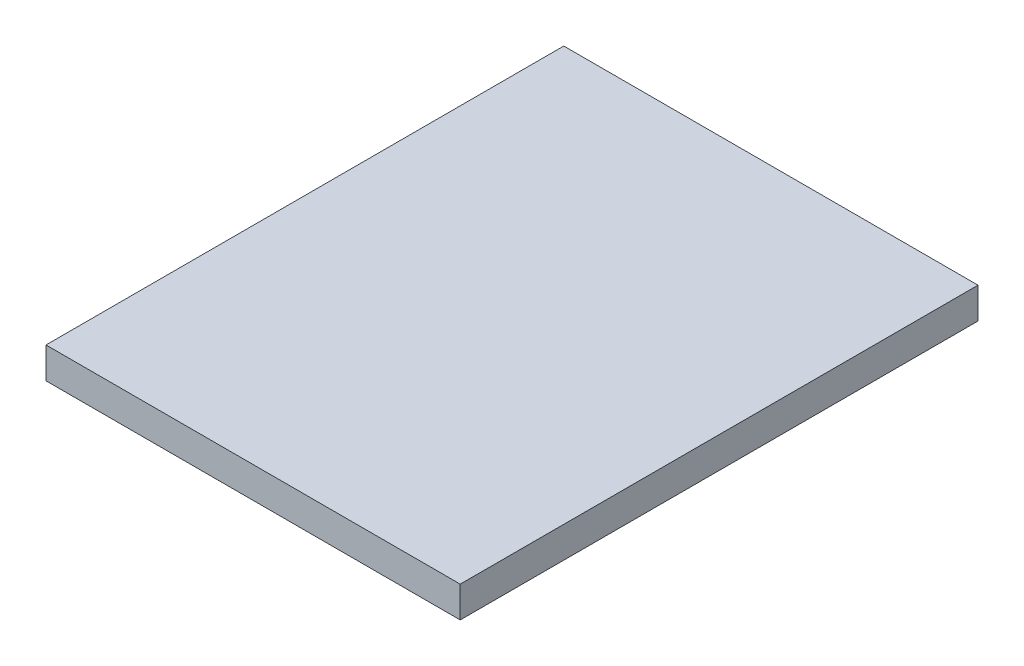
ISO-10303-21;
HEADER;
FILE_DESCRIPTION(('STEP AP214'),'2;1');
FILE_NAME('part.step','',(''),(''),'','','');
FILE_SCHEMA(('AUTOMOTIVE_DESIGN { 1 0 10303 214 1 1 1 1 }'));
ENDSEC;
DATA;
#1=APPLICATION_CONTEXT('core data for automotive mechanical design processes');
#2=APPLICATION_PROTOCOL_DEFINITION('international standard','automotive_design',2000,#1);
#3=PRODUCT_CONTEXT('',#1,'mechanical');
#4=PRODUCT('Part','Part','',(#3));
#5=PRODUCT_RELATED_PRODUCT_CATEGORY('part','',(#4));
#6=PRODUCT_DEFINITION_FORMATION('','',#4);
#7=PRODUCT_DEFINITION_CONTEXT('part definition',#1,'design');
#8=PRODUCT_DEFINITION('design','',#6,#7);
#9=PRODUCT_DEFINITION_SHAPE('','',#8);
#10=(LENGTH_UNIT() NAMED_UNIT(*) SI_UNIT(.MILLI.,.METRE.));
#11=(NAMED_UNIT(*) PLANE_ANGLE_UNIT() SI_UNIT($,.RADIAN.));
#12=(NAMED_UNIT(*) SI_UNIT($,.STERADIAN.) SOLID_ANGLE_UNIT());
#13=UNCERTAINTY_MEASURE_WITH_UNIT(LENGTH_MEASURE(1.E-05),#10,'distance_accuracy_value','');
#14=(GEOMETRIC_REPRESENTATION_CONTEXT(3) GLOBAL_UNCERTAINTY_ASSIGNED_CONTEXT((#13)) GLOBAL_UNIT_ASSIGNED_CONTEXT((#10,
#11,#12)) REPRESENTATION_CONTEXT('',''));
#15=CARTESIAN_POINT('',(0.,0.,0.));
#16=DIRECTION('',(0.,0.,1.));
#17=DIRECTION('',(1.,0.,0.));
#18=AXIS2_PLACEMENT_3D('',#15,#16,#17);
#19=CARTESIAN_POINT('',(-260.,25.5,325.));
#20=DIRECTION('',(1.,0.,0.));
#21=DIRECTION('',(0.,0.,-1.));
#22=AXIS2_PLACEMENT_3D('',#19,#20,#21);
#23=PLANE('',#22);
#24=DIRECTION('',(0.,0.,1.));
#25=VECTOR('',#24,1.);
#26=CARTESIAN_POINT('',(-260.,-19.5,325.));
#27=LINE('',#26,#25);
#28=CARTESIAN_POINT('',(-260.,-19.5,-425.));
#29=VERTEX_POINT('',#28);
#30=CARTESIAN_POINT('',(-260.,-19.5,325.));
#31=VERTEX_POINT('',#30);
#32=EDGE_CURVE('E106',#29,#31,#27,.T.);
#33=ORIENTED_EDGE('',*,*,#32,.T.);
#34=DIRECTION('',(0.,-1.,0.));
#35=VECTOR('',#34,1.);
#36=CARTESIAN_POINT('',(-260.,25.5,325.));
#37=LINE('',#36,#35);
#38=CARTESIAN_POINT('',(-260.,25.5,325.));
#39=VERTEX_POINT('',#38);
#40=EDGE_CURVE('E11',#39,#31,#37,.T.);
#41=ORIENTED_EDGE('',*,*,#40,.F.);
#42=DIRECTION('',(0.,0.,1.));
#43=VECTOR('',#42,1.);
#44=CARTESIAN_POINT('',(-260.,25.5,325.));
#45=LINE('',#44,#43);
#46=CARTESIAN_POINT('',(-260.,25.5,-425.));
#47=VERTEX_POINT('',#46);
#48=EDGE_CURVE('E90',#47,#39,#45,.T.);
#49=ORIENTED_EDGE('',*,*,#48,.F.);
#50=DIRECTION('',(0.,-1.,0.));
#51=VECTOR('',#50,1.);
#52=CARTESIAN_POINT('',(-260.,25.5,-425.));
#53=LINE('',#52,#51);
#54=EDGE_CURVE('E102',#47,#29,#53,.T.);
#55=ORIENTED_EDGE('',*,*,#54,.T.);
#56=EDGE_LOOP('',(#33,#41,#49,#55));
#57=FACE_BOUND('',#56,.T.);
#58=ADVANCED_FACE('F38',(#57),#23,.F.);
#59=CARTESIAN_POINT('',(-260.,25.5,325.));
#60=DIRECTION('',(0.,0.,-1.));
#61=DIRECTION('',(-1.,0.,0.));
#62=AXIS2_PLACEMENT_3D('',#59,#60,#61);
#63=PLANE('',#62);
#64=DIRECTION('',(1.,0.,0.));
#65=VECTOR('',#64,1.);
#66=CARTESIAN_POINT('',(-260.,-19.5,325.));
#67=LINE('',#66,#65);
#68=CARTESIAN_POINT('',(340.,-19.5,325.));
#69=VERTEX_POINT('',#68);
#70=EDGE_CURVE('E95',#31,#69,#67,.T.);
#71=ORIENTED_EDGE('',*,*,#70,.T.);
#72=DIRECTION('',(0.,-1.,0.));
#73=VECTOR('',#72,1.);
#74=CARTESIAN_POINT('',(340.,25.5,325.));
#75=LINE('',#74,#73);
#76=CARTESIAN_POINT('',(340.,25.5,325.));
#77=VERTEX_POINT('',#76);
#78=EDGE_CURVE('E47',#77,#69,#75,.T.);
#79=ORIENTED_EDGE('',*,*,#78,.F.);
#80=DIRECTION('',(1.,0.,0.));
#81=VECTOR('',#80,1.);
#82=CARTESIAN_POINT('',(-260.,25.5,325.));
#83=LINE('',#82,#81);
#84=EDGE_CURVE('E85',#39,#77,#83,.T.);
#85=ORIENTED_EDGE('',*,*,#84,.F.);
#86=ORIENTED_EDGE('',*,*,#40,.T.);
#87=EDGE_LOOP('',(#71,#79,#85,#86));
#88=FACE_BOUND('',#87,.T.);
#89=ADVANCED_FACE('F94',(#88),#63,.F.);
#90=CARTESIAN_POINT('',(340.,25.5,325.));
#91=DIRECTION('',(-1.,0.,0.));
#92=DIRECTION('',(0.,0.,1.));
#93=AXIS2_PLACEMENT_3D('',#90,#91,#92);
#94=PLANE('',#93);
#95=DIRECTION('',(0.,0.,-1.));
#96=VECTOR('',#95,1.);
#97=CARTESIAN_POINT('',(340.,-19.5,325.));
#98=LINE('',#97,#96);
#99=CARTESIAN_POINT('',(340.,-19.5,-425.));
#100=VERTEX_POINT('',#99);
#101=EDGE_CURVE('E72',#69,#100,#98,.T.);
#102=ORIENTED_EDGE('',*,*,#101,.T.);
#103=DIRECTION('',(0.,-1.,0.));
#104=VECTOR('',#103,1.);
#105=CARTESIAN_POINT('',(340.,25.5,-425.));
#106=LINE('',#105,#104);
#107=CARTESIAN_POINT('',(340.,25.5,-425.));
#108=VERTEX_POINT('',#107);
#109=EDGE_CURVE('E97',#108,#100,#106,.T.);
#110=ORIENTED_EDGE('',*,*,#109,.F.);
#111=DIRECTION('',(0.,0.,-1.));
#112=VECTOR('',#111,1.);
#113=CARTESIAN_POINT('',(340.,25.5,325.));
#114=LINE('',#113,#112);
#115=EDGE_CURVE('E88',#77,#108,#114,.T.);
#116=ORIENTED_EDGE('',*,*,#115,.F.);
#117=ORIENTED_EDGE('',*,*,#78,.T.);
#118=EDGE_LOOP('',(#102,#110,#116,#117));
#119=FACE_BOUND('',#118,.T.);
#120=ADVANCED_FACE('F98',(#119),#94,.F.);
#121=CARTESIAN_POINT('',(-260.,25.5,-425.));
#122=DIRECTION('',(0.,0.,1.));
#123=DIRECTION('',(1.,0.,0.));
#124=AXIS2_PLACEMENT_3D('',#121,#122,#123);
#125=PLANE('',#124);
#126=DIRECTION('',(-1.,0.,0.));
#127=VECTOR('',#126,1.);
#128=CARTESIAN_POINT('',(-260.,-19.5,-425.));
#129=LINE('',#128,#127);
#130=EDGE_CURVE('E78',#100,#29,#129,.T.);
#131=ORIENTED_EDGE('',*,*,#130,.T.);
#132=ORIENTED_EDGE('',*,*,#54,.F.);
#133=DIRECTION('',(-1.,0.,0.));
#134=VECTOR('',#133,1.);
#135=CARTESIAN_POINT('',(-260.,25.5,-425.));
#136=LINE('',#135,#134);
#137=EDGE_CURVE('E55',#108,#47,#136,.T.);
#138=ORIENTED_EDGE('',*,*,#137,.F.);
#139=ORIENTED_EDGE('',*,*,#109,.T.);
#140=EDGE_LOOP('',(#131,#132,#138,#139));
#141=FACE_BOUND('',#140,.T.);
#142=ADVANCED_FACE('F119',(#141),#125,.F.);
#143=CARTESIAN_POINT('',(-260.,25.5,325.));
#144=DIRECTION('',(0.,-1.,0.));
#145=DIRECTION('',(0.,0.,-1.));
#146=AXIS2_PLACEMENT_3D('',#143,#144,#145);
#147=PLANE('',#146);
#148=ORIENTED_EDGE('',*,*,#48,.T.);
#149=ORIENTED_EDGE('',*,*,#84,.T.);
#150=ORIENTED_EDGE('',*,*,#115,.T.);
#151=ORIENTED_EDGE('',*,*,#137,.T.);
#152=EDGE_LOOP('',(#148,#149,#150,#151));
#153=FACE_BOUND('',#152,.T.);
#154=ADVANCED_FACE('F86',(#153),#147,.F.);
#155=CARTESIAN_POINT('',(-260.,-19.5,325.));
#156=DIRECTION('',(0.,-1.,0.));
#157=DIRECTION('',(0.,0.,-1.));
#158=AXIS2_PLACEMENT_3D('',#155,#156,#157);
#159=PLANE('',#158);
#160=ORIENTED_EDGE('',*,*,#32,.F.);
#161=ORIENTED_EDGE('',*,*,#130,.F.);
#162=ORIENTED_EDGE('',*,*,#101,.F.);
#163=ORIENTED_EDGE('',*,*,#70,.F.);
#164=EDGE_LOOP('',(#160,#161,#162,#163));
#165=FACE_BOUND('',#164,.T.);
#166=ADVANCED_FACE('F122',(#165),#159,.T.);
#167=CLOSED_SHELL('',(#58,#89,#120,#142,#154,#166));
#168=MANIFOLD_SOLID_BREP('B2',#167);
#169=ADVANCED_BREP_SHAPE_REPRESENTATION('',(#18,#168),#14);
#170=SHAPE_DEFINITION_REPRESENTATION(#9,#169);
ENDSEC;
END-ISO-10303-21;
